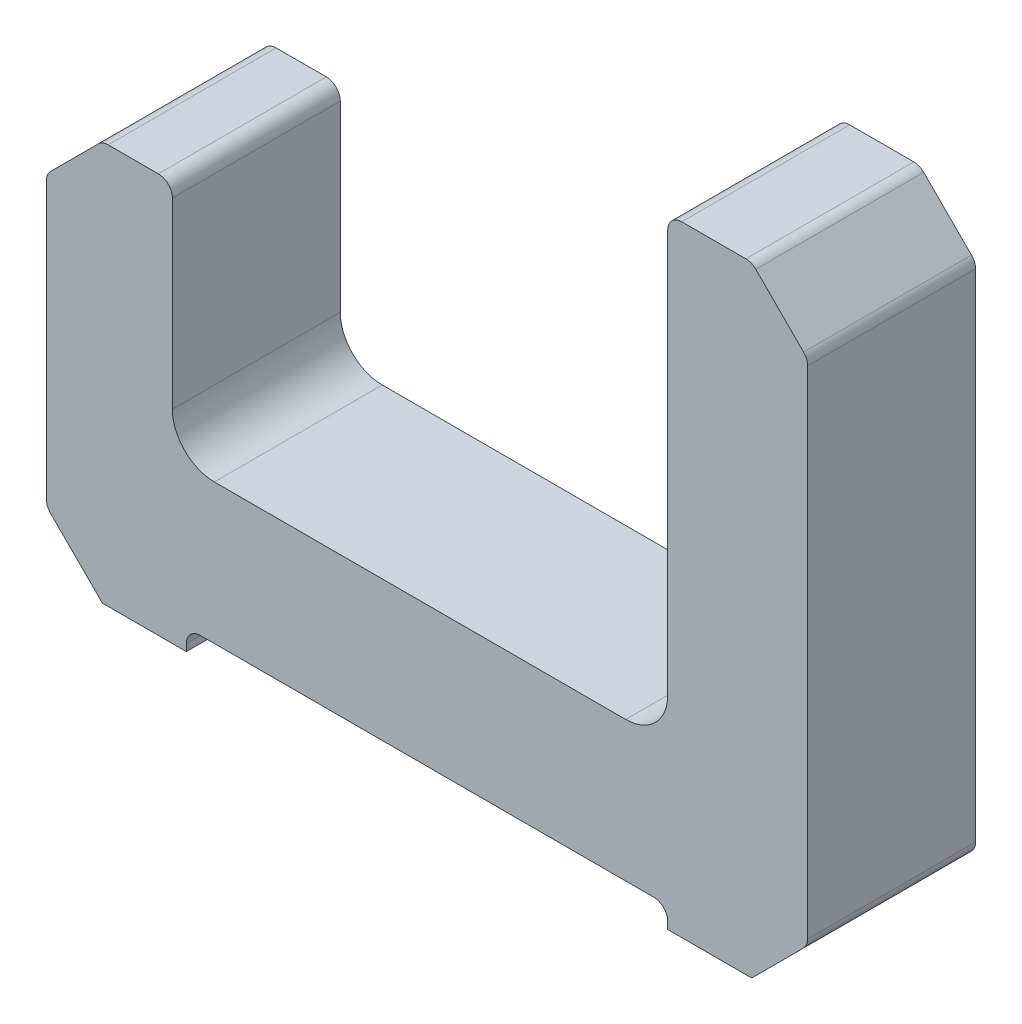
ISO-10303-21;
HEADER;
FILE_DESCRIPTION(('STEP AP214'),'2;1');
FILE_NAME('part.step','',(''),(''),'','','');
FILE_SCHEMA(('AUTOMOTIVE_DESIGN { 1 0 10303 214 1 1 1 1 }'));
ENDSEC;
DATA;
#1=APPLICATION_CONTEXT('core data for automotive mechanical design processes');
#2=APPLICATION_PROTOCOL_DEFINITION('international standard','automotive_design',2000,#1);
#3=PRODUCT_CONTEXT('',#1,'mechanical');
#4=PRODUCT('Part','Part','',(#3));
#5=PRODUCT_RELATED_PRODUCT_CATEGORY('part','',(#4));
#6=PRODUCT_DEFINITION_FORMATION('','',#4);
#7=PRODUCT_DEFINITION_CONTEXT('part definition',#1,'design');
#8=PRODUCT_DEFINITION('design','',#6,#7);
#9=PRODUCT_DEFINITION_SHAPE('','',#8);
#10=(LENGTH_UNIT() NAMED_UNIT(*) SI_UNIT(.MILLI.,.METRE.));
#11=(NAMED_UNIT(*) PLANE_ANGLE_UNIT() SI_UNIT($,.RADIAN.));
#12=(NAMED_UNIT(*) SI_UNIT($,.STERADIAN.) SOLID_ANGLE_UNIT());
#13=UNCERTAINTY_MEASURE_WITH_UNIT(LENGTH_MEASURE(1.E-05),#10,'distance_accuracy_value','');
#14=(GEOMETRIC_REPRESENTATION_CONTEXT(3) GLOBAL_UNCERTAINTY_ASSIGNED_CONTEXT((#13)) GLOBAL_UNIT_ASSIGNED_CONTEXT((#10,
#11,#12)) REPRESENTATION_CONTEXT('',''));
#15=CARTESIAN_POINT('',(0.,0.,0.));
#16=DIRECTION('',(0.,0.,1.));
#17=DIRECTION('',(1.,0.,0.));
#18=AXIS2_PLACEMENT_3D('',#15,#16,#17);
#19=CARTESIAN_POINT('',(-133.5,-57.5,-30.));
#20=DIRECTION('',(-1.,0.,0.));
#21=DIRECTION('',(0.,0.,1.));
#22=AXIS2_PLACEMENT_3D('',#19,#20,#21);
#23=PLANE('',#22);
#24=DIRECTION('',(0.,-1.,0.));
#25=VECTOR('',#24,1.);
#26=CARTESIAN_POINT('',(-133.5,-57.5,-30.));
#27=LINE('',#26,#25);
#28=CARTESIAN_POINT('',(-133.5,63.267387760078,-30.));
#29=VERTEX_POINT('',#28);
#30=CARTESIAN_POINT('',(-133.5,-35.4289321881344,-30.));
#31=VERTEX_POINT('',#30);
#32=EDGE_CURVE('E271',#29,#31,#27,.T.);
#33=ORIENTED_EDGE('',*,*,#32,.T.);
#34=DIRECTION('',(0.,0.,-1.));
#35=VECTOR('',#34,1.);
#36=CARTESIAN_POINT('',(-133.5,-35.4289321881344,-30.));
#37=LINE('',#36,#35);
#38=CARTESIAN_POINT('',(-133.5,-35.4289321881344,30.));
#39=VERTEX_POINT('',#38);
#40=EDGE_CURVE('E396',#31,#39,#37,.F.);
#41=ORIENTED_EDGE('',*,*,#40,.T.);
#42=DIRECTION('',(0.,-1.,0.));
#43=VECTOR('',#42,1.);
#44=CARTESIAN_POINT('',(-133.5,-57.5,30.));
#45=LINE('',#44,#43);
#46=CARTESIAN_POINT('',(-133.5,63.267387760078,30.));
#47=VERTEX_POINT('',#46);
#48=EDGE_CURVE('E227',#47,#39,#45,.T.);
#49=ORIENTED_EDGE('',*,*,#48,.F.);
#50=DIRECTION('',(0.,0.,1.));
#51=VECTOR('',#50,1.);
#52=CARTESIAN_POINT('',(-133.5,63.267387760078,-30.));
#53=LINE('',#52,#51);
#54=EDGE_CURVE('E393',#47,#29,#53,.F.);
#55=ORIENTED_EDGE('',*,*,#54,.T.);
#56=EDGE_LOOP('',(#33,#41,#49,#55));
#57=FACE_BOUND('',#56,.T.);
#58=ADVANCED_FACE('F33',(#57),#23,.T.);
#59=CARTESIAN_POINT('',(-133.5,85.3384555719439,-30.));
#60=DIRECTION('',(0.,1.,0.));
#61=DIRECTION('',(0.,0.,1.));
#62=AXIS2_PLACEMENT_3D('',#59,#60,#61);
#63=PLANE('',#62);
#64=DIRECTION('',(-1.,0.,0.));
#65=VECTOR('',#64,1.);
#66=CARTESIAN_POINT('',(-133.5,85.3384555719439,-30.));
#67=LINE('',#66,#65);
#68=CARTESIAN_POINT('',(-93.5,85.3384555719439,-30.));
#69=VERTEX_POINT('',#68);
#70=CARTESIAN_POINT('',(-111.428932188134,85.3384555719439,-30.));
#71=VERTEX_POINT('',#70);
#72=EDGE_CURVE('E238',#69,#71,#67,.T.);
#73=ORIENTED_EDGE('',*,*,#72,.T.);
#74=DIRECTION('',(0.,0.,-1.));
#75=VECTOR('',#74,1.);
#76=CARTESIAN_POINT('',(-111.428932188134,85.3384555719439,-30.));
#77=LINE('',#76,#75);
#78=CARTESIAN_POINT('',(-111.428932188134,85.3384555719439,30.));
#79=VERTEX_POINT('',#78);
#80=EDGE_CURVE('E406',#71,#79,#77,.F.);
#81=ORIENTED_EDGE('',*,*,#80,.T.);
#82=DIRECTION('',(-1.,0.,0.));
#83=VECTOR('',#82,1.);
#84=CARTESIAN_POINT('',(-133.5,85.3384555719439,30.));
#85=LINE('',#84,#83);
#86=CARTESIAN_POINT('',(-93.5,85.3384555719439,30.));
#87=VERTEX_POINT('',#86);
#88=EDGE_CURVE('E269',#87,#79,#85,.T.);
#89=ORIENTED_EDGE('',*,*,#88,.F.);
#90=DIRECTION('',(0.,0.,1.));
#91=VECTOR('',#90,1.);
#92=CARTESIAN_POINT('',(-93.5,85.3384555719439,-30.));
#93=LINE('',#92,#91);
#94=EDGE_CURVE('E404',#87,#69,#93,.F.);
#95=ORIENTED_EDGE('',*,*,#94,.T.);
#96=EDGE_LOOP('',(#73,#81,#89,#95));
#97=FACE_BOUND('',#96,.T.);
#98=ADVANCED_FACE('F515',(#97),#63,.T.);
#99=CARTESIAN_POINT('',(-88.5,85.3384555719439,-30.));
#100=DIRECTION('',(1.,0.,0.));
#101=DIRECTION('',(0.,1.,0.));
#102=AXIS2_PLACEMENT_3D('',#99,#100,#101);
#103=PLANE('',#102);
#104=DIRECTION('',(0.,1.,0.));
#105=VECTOR('',#104,1.);
#106=CARTESIAN_POINT('',(-88.5,85.3384555719439,-30.));
#107=LINE('',#106,#105);
#108=CARTESIAN_POINT('',(-88.5,15.,-30.));
#109=VERTEX_POINT('',#108);
#110=CARTESIAN_POINT('',(-88.5,80.3384555719439,-30.));
#111=VERTEX_POINT('',#110);
#112=EDGE_CURVE('E296',#109,#111,#107,.T.);
#113=ORIENTED_EDGE('',*,*,#112,.T.);
#114=DIRECTION('',(0.,0.,1.));
#115=VECTOR('',#114,1.);
#116=CARTESIAN_POINT('',(-88.5,80.3384555719439,-30.));
#117=LINE('',#116,#115);
#118=CARTESIAN_POINT('',(-88.5,80.3384555719439,30.));
#119=VERTEX_POINT('',#118);
#120=EDGE_CURVE('E409',#111,#119,#117,.T.);
#121=ORIENTED_EDGE('',*,*,#120,.T.);
#122=DIRECTION('',(0.,1.,0.));
#123=VECTOR('',#122,1.);
#124=CARTESIAN_POINT('',(-88.5,85.3384555719439,30.));
#125=LINE('',#124,#123);
#126=CARTESIAN_POINT('',(-88.5,15.,30.));
#127=VERTEX_POINT('',#126);
#128=EDGE_CURVE('E266',#127,#119,#125,.T.);
#129=ORIENTED_EDGE('',*,*,#128,.F.);
#130=DIRECTION('',(0.,0.,1.));
#131=VECTOR('',#130,1.);
#132=CARTESIAN_POINT('',(-88.5,15.,-30.));
#133=LINE('',#132,#131);
#134=EDGE_CURVE('E335',#127,#109,#133,.F.);
#135=ORIENTED_EDGE('',*,*,#134,.T.);
#136=EDGE_LOOP('',(#113,#121,#129,#135));
#137=FACE_BOUND('',#136,.T.);
#138=ADVANCED_FACE('F506',(#137),#103,.T.);
#139=CARTESIAN_POINT('',(-88.5,0.,-30.));
#140=DIRECTION('',(0.,1.,0.));
#141=DIRECTION('',(0.,0.,1.));
#142=AXIS2_PLACEMENT_3D('',#139,#140,#141);
#143=PLANE('',#142);
#144=DIRECTION('',(-1.,0.,0.));
#145=VECTOR('',#144,1.);
#146=CARTESIAN_POINT('',(-88.5,0.,30.));
#147=LINE('',#146,#145);
#148=CARTESIAN_POINT('',(73.5,0.,30.));
#149=VERTEX_POINT('',#148);
#150=CARTESIAN_POINT('',(-73.5,0.,30.));
#151=VERTEX_POINT('',#150);
#152=EDGE_CURVE('E263',#149,#151,#147,.T.);
#153=ORIENTED_EDGE('',*,*,#152,.F.);
#154=DIRECTION('',(0.,0.,1.));
#155=VECTOR('',#154,1.);
#156=CARTESIAN_POINT('',(73.5,0.,-30.));
#157=LINE('',#156,#155);
#158=CARTESIAN_POINT('',(73.5,0.,-30.));
#159=VERTEX_POINT('',#158);
#160=EDGE_CURVE('E333',#149,#159,#157,.F.);
#161=ORIENTED_EDGE('',*,*,#160,.T.);
#162=DIRECTION('',(-1.,0.,0.));
#163=VECTOR('',#162,1.);
#164=CARTESIAN_POINT('',(-88.5,0.,-30.));
#165=LINE('',#164,#163);
#166=CARTESIAN_POINT('',(-73.5,0.,-30.));
#167=VERTEX_POINT('',#166);
#168=EDGE_CURVE('E293',#159,#167,#165,.T.);
#169=ORIENTED_EDGE('',*,*,#168,.T.);
#170=DIRECTION('',(0.,0.,1.));
#171=VECTOR('',#170,1.);
#172=CARTESIAN_POINT('',(-73.5,0.,30.));
#173=LINE('',#172,#171);
#174=EDGE_CURVE('E330',#167,#151,#173,.T.);
#175=ORIENTED_EDGE('',*,*,#174,.T.);
#176=EDGE_LOOP('',(#153,#161,#169,#175));
#177=FACE_BOUND('',#176,.T.);
#178=ADVANCED_FACE('F497',(#177),#143,.T.);
#179=CARTESIAN_POINT('',(88.5,0.,-30.));
#180=DIRECTION('',(-1.,0.,0.));
#181=DIRECTION('',(0.,0.,1.));
#182=AXIS2_PLACEMENT_3D('',#179,#180,#181);
#183=PLANE('',#182);
#184=DIRECTION('',(0.,-1.,0.));
#185=VECTOR('',#184,1.);
#186=CARTESIAN_POINT('',(88.5,0.,30.));
#187=LINE('',#186,#185);
#188=CARTESIAN_POINT('',(88.5,159.,30.));
#189=VERTEX_POINT('',#188);
#190=CARTESIAN_POINT('',(88.5,15.,30.));
#191=VERTEX_POINT('',#190);
#192=EDGE_CURVE('E261',#189,#191,#187,.T.);
#193=ORIENTED_EDGE('',*,*,#192,.F.);
#194=DIRECTION('',(0.,0.,1.));
#195=VECTOR('',#194,1.);
#196=CARTESIAN_POINT('',(88.5,159.,-30.));
#197=LINE('',#196,#195);
#198=CARTESIAN_POINT('',(88.5,159.,-30.));
#199=VERTEX_POINT('',#198);
#200=EDGE_CURVE('E422',#189,#199,#197,.F.);
#201=ORIENTED_EDGE('',*,*,#200,.T.);
#202=DIRECTION('',(0.,-1.,0.));
#203=VECTOR('',#202,1.);
#204=CARTESIAN_POINT('',(88.5,0.,-30.));
#205=LINE('',#204,#203);
#206=CARTESIAN_POINT('',(88.5,15.,-30.));
#207=VERTEX_POINT('',#206);
#208=EDGE_CURVE('E291',#199,#207,#205,.T.);
#209=ORIENTED_EDGE('',*,*,#208,.T.);
#210=DIRECTION('',(0.,0.,1.));
#211=VECTOR('',#210,1.);
#212=CARTESIAN_POINT('',(88.5,15.,30.));
#213=LINE('',#212,#211);
#214=EDGE_CURVE('E327',#207,#191,#213,.T.);
#215=ORIENTED_EDGE('',*,*,#214,.T.);
#216=EDGE_LOOP('',(#193,#201,#209,#215));
#217=FACE_BOUND('',#216,.T.);
#218=ADVANCED_FACE('F488',(#217),#183,.T.);
#219=CARTESIAN_POINT('',(88.5,164.,-30.));
#220=DIRECTION('',(0.,1.,0.));
#221=DIRECTION('',(0.,0.,1.));
#222=AXIS2_PLACEMENT_3D('',#219,#220,#221);
#223=PLANE('',#222);
#224=DIRECTION('',(-1.,0.,0.));
#225=VECTOR('',#224,1.);
#226=CARTESIAN_POINT('',(88.5,164.,30.));
#227=LINE('',#226,#225);
#228=CARTESIAN_POINT('',(116.428932188134,164.,30.));
#229=VERTEX_POINT('',#228);
#230=CARTESIAN_POINT('',(93.5,164.,30.));
#231=VERTEX_POINT('',#230);
#232=EDGE_CURVE('E258',#229,#231,#227,.T.);
#233=ORIENTED_EDGE('',*,*,#232,.F.);
#234=DIRECTION('',(0.,0.,1.));
#235=VECTOR('',#234,1.);
#236=CARTESIAN_POINT('',(116.428932188134,164.,-30.));
#237=LINE('',#236,#235);
#238=CARTESIAN_POINT('',(116.428932188134,164.,-30.));
#239=VERTEX_POINT('',#238);
#240=EDGE_CURVE('E419',#229,#239,#237,.F.);
#241=ORIENTED_EDGE('',*,*,#240,.T.);
#242=DIRECTION('',(-1.,0.,0.));
#243=VECTOR('',#242,1.);
#244=CARTESIAN_POINT('',(88.5,164.,-30.));
#245=LINE('',#244,#243);
#246=CARTESIAN_POINT('',(93.5,164.,-30.));
#247=VERTEX_POINT('',#246);
#248=EDGE_CURVE('E288',#239,#247,#245,.T.);
#249=ORIENTED_EDGE('',*,*,#248,.T.);
#250=DIRECTION('',(0.,0.,1.));
#251=VECTOR('',#250,1.);
#252=CARTESIAN_POINT('',(93.5,164.,-30.));
#253=LINE('',#252,#251);
#254=EDGE_CURVE('E416',#247,#231,#253,.T.);
#255=ORIENTED_EDGE('',*,*,#254,.T.);
#256=EDGE_LOOP('',(#233,#241,#249,#255));
#257=FACE_BOUND('',#256,.T.);
#258=ADVANCED_FACE('F479',(#257),#223,.T.);
#259=CARTESIAN_POINT('',(138.5,164.,-30.));
#260=DIRECTION('',(1.,0.,0.));
#261=DIRECTION('',(0.,1.,0.));
#262=AXIS2_PLACEMENT_3D('',#259,#260,#261);
#263=PLANE('',#262);
#264=DIRECTION('',(0.,1.,0.));
#265=VECTOR('',#264,1.);
#266=CARTESIAN_POINT('',(138.5,164.,30.));
#267=LINE('',#266,#265);
#268=CARTESIAN_POINT('',(138.5,-35.4289321881342,30.));
#269=VERTEX_POINT('',#268);
#270=CARTESIAN_POINT('',(138.5,141.928932188134,30.));
#271=VERTEX_POINT('',#270);
#272=EDGE_CURVE('E255',#269,#271,#267,.T.);
#273=ORIENTED_EDGE('',*,*,#272,.F.);
#274=DIRECTION('',(0.,0.,1.));
#275=VECTOR('',#274,1.);
#276=CARTESIAN_POINT('',(138.5,-35.4289321881342,-30.));
#277=LINE('',#276,#275);
#278=CARTESIAN_POINT('',(138.5,-35.4289321881342,-30.));
#279=VERTEX_POINT('',#278);
#280=EDGE_CURVE('E349',#269,#279,#277,.F.);
#281=ORIENTED_EDGE('',*,*,#280,.T.);
#282=DIRECTION('',(0.,1.,0.));
#283=VECTOR('',#282,1.);
#284=CARTESIAN_POINT('',(138.5,164.,-30.));
#285=LINE('',#284,#283);
#286=CARTESIAN_POINT('',(138.5,141.928932188134,-30.));
#287=VERTEX_POINT('',#286);
#288=EDGE_CURVE('E285',#279,#287,#285,.T.);
#289=ORIENTED_EDGE('',*,*,#288,.T.);
#290=DIRECTION('',(0.,0.,-1.));
#291=VECTOR('',#290,1.);
#292=CARTESIAN_POINT('',(138.5,141.928932188134,-30.));
#293=LINE('',#292,#291);
#294=EDGE_CURVE('E346',#287,#271,#293,.F.);
#295=ORIENTED_EDGE('',*,*,#294,.T.);
#296=EDGE_LOOP('',(#273,#281,#289,#295));
#297=FACE_BOUND('',#296,.T.);
#298=ADVANCED_FACE('F461',(#297),#263,.T.);
#299=CARTESIAN_POINT('',(138.5,-57.5,-30.));
#300=DIRECTION('',(0.,-1.,0.));
#301=DIRECTION('',(1.,0.,0.));
#302=AXIS2_PLACEMENT_3D('',#299,#300,#301);
#303=PLANE('',#302);
#304=DIRECTION('',(1.,0.,0.));
#305=VECTOR('',#304,1.);
#306=CARTESIAN_POINT('',(138.5,-57.5,-30.));
#307=LINE('',#306,#305);
#308=CARTESIAN_POINT('',(88.5,-57.5,-30.));
#309=VERTEX_POINT('',#308);
#310=CARTESIAN_POINT('',(118.5,-57.5,-30.));
#311=VERTEX_POINT('',#310);
#312=EDGE_CURVE('E282',#309,#311,#307,.T.);
#313=ORIENTED_EDGE('',*,*,#312,.T.);
#314=DIRECTION('',(0.,0.,1.));
#315=VECTOR('',#314,1.);
#316=CARTESIAN_POINT('',(118.5,-57.5,-30.));
#317=LINE('',#316,#315);
#318=CARTESIAN_POINT('',(118.5,-57.5,30.));
#319=VERTEX_POINT('',#318);
#320=EDGE_CURVE('E324',#311,#319,#317,.T.);
#321=ORIENTED_EDGE('',*,*,#320,.T.);
#322=DIRECTION('',(1.,0.,0.));
#323=VECTOR('',#322,1.);
#324=CARTESIAN_POINT('',(138.5,-57.5,30.));
#325=LINE('',#324,#323);
#326=CARTESIAN_POINT('',(88.5,-57.5,30.));
#327=VERTEX_POINT('',#326);
#328=EDGE_CURVE('E252',#327,#319,#325,.T.);
#329=ORIENTED_EDGE('',*,*,#328,.F.);
#330=DIRECTION('',(0.,0.,1.));
#331=VECTOR('',#330,1.);
#332=CARTESIAN_POINT('',(88.5,-57.5,-30.));
#333=LINE('',#332,#331);
#334=EDGE_CURVE('E237',#309,#327,#333,.T.);
#335=ORIENTED_EDGE('',*,*,#334,.F.);
#336=EDGE_LOOP('',(#313,#321,#329,#335));
#337=FACE_BOUND('',#336,.T.);
#338=ADVANCED_FACE('F451',(#337),#303,.T.);
#339=CARTESIAN_POINT('',(88.5,-57.5,-30.));
#340=DIRECTION('',(-1.,0.,0.));
#341=DIRECTION('',(0.,0.,1.));
#342=AXIS2_PLACEMENT_3D('',#339,#340,#341);
#343=PLANE('',#342);
#344=DIRECTION('',(0.,-1.,0.));
#345=VECTOR('',#344,1.);
#346=CARTESIAN_POINT('',(88.5,-57.5,30.));
#347=LINE('',#346,#345);
#348=CARTESIAN_POINT('',(88.5,-55.,30.));
#349=VERTEX_POINT('',#348);
#350=EDGE_CURVE('E247',#349,#327,#347,.T.);
#351=ORIENTED_EDGE('',*,*,#350,.F.);
#352=DIRECTION('',(0.,0.,1.));
#353=VECTOR('',#352,1.);
#354=CARTESIAN_POINT('',(88.5,-55.,-30.));
#355=LINE('',#354,#353);
#356=CARTESIAN_POINT('',(88.5,-55.,-30.));
#357=VERTEX_POINT('',#356);
#358=EDGE_CURVE('E390',#349,#357,#355,.F.);
#359=ORIENTED_EDGE('',*,*,#358,.T.);
#360=DIRECTION('',(0.,-1.,0.));
#361=VECTOR('',#360,1.);
#362=CARTESIAN_POINT('',(88.5,-57.5,-30.));
#363=LINE('',#362,#361);
#364=EDGE_CURVE('E280',#357,#309,#363,.T.);
#365=ORIENTED_EDGE('',*,*,#364,.T.);
#366=ORIENTED_EDGE('',*,*,#334,.T.);
#367=EDGE_LOOP('',(#351,#359,#365,#366));
#368=FACE_BOUND('',#367,.T.);
#369=ADVANCED_FACE('F446',(#368),#343,.T.);
#370=CARTESIAN_POINT('',(88.5,-50.,-30.));
#371=DIRECTION('',(0.,-1.,0.));
#372=DIRECTION('',(1.,0.,0.));
#373=AXIS2_PLACEMENT_3D('',#370,#371,#372);
#374=PLANE('',#373);
#375=DIRECTION('',(1.,0.,0.));
#376=VECTOR('',#375,1.);
#377=CARTESIAN_POINT('',(88.5,-50.,-30.));
#378=LINE('',#377,#376);
#379=CARTESIAN_POINT('',(-78.5,-50.,-30.));
#380=VERTEX_POINT('',#379);
#381=CARTESIAN_POINT('',(83.5,-50.,-30.));
#382=VERTEX_POINT('',#381);
#383=EDGE_CURVE('E277',#380,#382,#378,.T.);
#384=ORIENTED_EDGE('',*,*,#383,.T.);
#385=DIRECTION('',(0.,0.,1.));
#386=VECTOR('',#385,1.);
#387=CARTESIAN_POINT('',(83.5,-50.,30.));
#388=LINE('',#387,#386);
#389=CARTESIAN_POINT('',(83.5,-50.,30.));
#390=VERTEX_POINT('',#389);
#391=EDGE_CURVE('E387',#382,#390,#388,.T.);
#392=ORIENTED_EDGE('',*,*,#391,.T.);
#393=DIRECTION('',(1.,0.,0.));
#394=VECTOR('',#393,1.);
#395=CARTESIAN_POINT('',(88.5,-50.,30.));
#396=LINE('',#395,#394);
#397=CARTESIAN_POINT('',(-78.5,-50.,30.));
#398=VERTEX_POINT('',#397);
#399=EDGE_CURVE('E244',#398,#390,#396,.T.);
#400=ORIENTED_EDGE('',*,*,#399,.F.);
#401=DIRECTION('',(0.,0.,1.));
#402=VECTOR('',#401,1.);
#403=CARTESIAN_POINT('',(-78.5,-50.,-30.));
#404=LINE('',#403,#402);
#405=EDGE_CURVE('E385',#398,#380,#404,.F.);
#406=ORIENTED_EDGE('',*,*,#405,.T.);
#407=EDGE_LOOP('',(#384,#392,#400,#406));
#408=FACE_BOUND('',#407,.T.);
#409=ADVANCED_FACE('F431',(#408),#374,.T.);
#410=CARTESIAN_POINT('',(-83.5,-50.,-30.));
#411=DIRECTION('',(1.,0.,0.));
#412=DIRECTION('',(0.,1.,0.));
#413=AXIS2_PLACEMENT_3D('',#410,#411,#412);
#414=PLANE('',#413);
#415=DIRECTION('',(0.,1.,0.));
#416=VECTOR('',#415,1.);
#417=CARTESIAN_POINT('',(-83.5,-50.,-30.));
#418=LINE('',#417,#416);
#419=CARTESIAN_POINT('',(-83.5,-57.5,-30.));
#420=VERTEX_POINT('',#419);
#421=CARTESIAN_POINT('',(-83.5,-55.,-30.));
#422=VERTEX_POINT('',#421);
#423=EDGE_CURVE('E275',#420,#422,#418,.T.);
#424=ORIENTED_EDGE('',*,*,#423,.T.);
#425=DIRECTION('',(0.,0.,1.));
#426=VECTOR('',#425,1.);
#427=CARTESIAN_POINT('',(-83.5,-55.,30.));
#428=LINE('',#427,#426);
#429=CARTESIAN_POINT('',(-83.5,-55.,30.));
#430=VERTEX_POINT('',#429);
#431=EDGE_CURVE('E243',#422,#430,#428,.T.);
#432=ORIENTED_EDGE('',*,*,#431,.T.);
#433=DIRECTION('',(0.,1.,0.));
#434=VECTOR('',#433,1.);
#435=CARTESIAN_POINT('',(-83.5,-50.,30.));
#436=LINE('',#435,#434);
#437=CARTESIAN_POINT('',(-83.5,-57.5,30.));
#438=VERTEX_POINT('',#437);
#439=EDGE_CURVE('E222',#438,#430,#436,.T.);
#440=ORIENTED_EDGE('',*,*,#439,.F.);
#441=DIRECTION('',(0.,0.,1.));
#442=VECTOR('',#441,1.);
#443=CARTESIAN_POINT('',(-83.5,-57.5,-30.));
#444=LINE('',#443,#442);
#445=EDGE_CURVE('E230',#420,#438,#444,.T.);
#446=ORIENTED_EDGE('',*,*,#445,.F.);
#447=EDGE_LOOP('',(#424,#432,#440,#446));
#448=FACE_BOUND('',#447,.T.);
#449=ADVANCED_FACE('F241',(#448),#414,.T.);
#450=CARTESIAN_POINT('',(-83.5,-57.5,-30.));
#451=DIRECTION('',(0.,-1.,0.));
#452=DIRECTION('',(0.,0.,-1.));
#453=AXIS2_PLACEMENT_3D('',#450,#451,#452);
#454=PLANE('',#453);
#455=DIRECTION('',(1.,0.,0.));
#456=VECTOR('',#455,1.);
#457=CARTESIAN_POINT('',(-83.5,-57.5,30.));
#458=LINE('',#457,#456);
#459=CARTESIAN_POINT('',(-113.5,-57.5,30.));
#460=VERTEX_POINT('',#459);
#461=EDGE_CURVE('E217',#460,#438,#458,.T.);
#462=ORIENTED_EDGE('',*,*,#461,.F.);
#463=DIRECTION('',(0.,0.,-1.));
#464=VECTOR('',#463,1.);
#465=CARTESIAN_POINT('',(-113.5,-57.5,-30.));
#466=LINE('',#465,#464);
#467=CARTESIAN_POINT('',(-113.5,-57.5,-30.));
#468=VERTEX_POINT('',#467);
#469=EDGE_CURVE('E311',#460,#468,#466,.T.);
#470=ORIENTED_EDGE('',*,*,#469,.T.);
#471=DIRECTION('',(1.,0.,0.));
#472=VECTOR('',#471,1.);
#473=CARTESIAN_POINT('',(-83.5,-57.5,-30.));
#474=LINE('',#473,#472);
#475=EDGE_CURVE('E233',#468,#420,#474,.T.);
#476=ORIENTED_EDGE('',*,*,#475,.T.);
#477=ORIENTED_EDGE('',*,*,#445,.T.);
#478=EDGE_LOOP('',(#462,#470,#476,#477));
#479=FACE_BOUND('',#478,.T.);
#480=ADVANCED_FACE('F231',(#479),#454,.T.);
#481=CARTESIAN_POINT('',(0.,0.,-30.));
#482=DIRECTION('',(0.,0.,-1.));
#483=DIRECTION('',(-1.,0.,0.));
#484=AXIS2_PLACEMENT_3D('',#481,#482,#483);
#485=PLANE('',#484);
#486=ORIENTED_EDGE('',*,*,#288,.F.);
#487=CARTESIAN_POINT('',(133.5,-35.4289321881342,-30.));
#488=DIRECTION('',(0.,0.,-1.));
#489=DIRECTION('',(-1.,0.,0.));
#490=AXIS2_PLACEMENT_3D('',#487,#488,#489);
#491=CIRCLE('',#490,5.);
#492=CARTESIAN_POINT('',(137.035533905933,-38.9644660940669,-30.));
#493=VERTEX_POINT('',#492);
#494=EDGE_CURVE('E366',#279,#493,#491,.T.);
#495=ORIENTED_EDGE('',*,*,#494,.T.);
#496=DIRECTION('',(0.707106781186544,0.707106781186551,0.));
#497=VECTOR('',#496,1.);
#498=CARTESIAN_POINT('',(88.0000000000006,-87.9999999999996,-30.));
#499=LINE('',#498,#497);
#500=EDGE_CURVE('E319',#493,#311,#499,.F.);
#501=ORIENTED_EDGE('',*,*,#500,.T.);
#502=ORIENTED_EDGE('',*,*,#312,.F.);
#503=ORIENTED_EDGE('',*,*,#364,.F.);
#504=CARTESIAN_POINT('',(83.5,-55.,-30.));
#505=DIRECTION('',(0.,0.,-1.));
#506=DIRECTION('',(-1.,0.,0.));
#507=AXIS2_PLACEMENT_3D('',#504,#505,#506);
#508=CIRCLE('',#507,5.);
#509=EDGE_CURVE('E426',#357,#382,#508,.F.);
#510=ORIENTED_EDGE('',*,*,#509,.T.);
#511=ORIENTED_EDGE('',*,*,#383,.F.);
#512=CARTESIAN_POINT('',(-78.5,-55.,-30.));
#513=DIRECTION('',(0.,0.,-1.));
#514=DIRECTION('',(-1.,0.,0.));
#515=AXIS2_PLACEMENT_3D('',#512,#513,#514);
#516=CIRCLE('',#515,5.);
#517=EDGE_CURVE('E11',#380,#422,#516,.F.);
#518=ORIENTED_EDGE('',*,*,#517,.T.);
#519=ORIENTED_EDGE('',*,*,#423,.F.);
#520=ORIENTED_EDGE('',*,*,#475,.F.);
#521=DIRECTION('',(0.707106781186551,-0.707106781186544,0.));
#522=VECTOR('',#521,1.);
#523=CARTESIAN_POINT('',(-85.4999999999993,-85.5000000000001,-30.));
#524=LINE('',#523,#522);
#525=CARTESIAN_POINT('',(-132.035533905933,-38.9644660940671,-30.));
#526=VERTEX_POINT('',#525);
#527=EDGE_CURVE('E321',#468,#526,#524,.F.);
#528=ORIENTED_EDGE('',*,*,#527,.T.);
#529=CARTESIAN_POINT('',(-128.5,-35.4289321881344,-30.));
#530=DIRECTION('',(0.,0.,-1.));
#531=DIRECTION('',(-1.,0.,0.));
#532=AXIS2_PLACEMENT_3D('',#529,#530,#531);
#533=CIRCLE('',#532,5.);
#534=EDGE_CURVE('E364',#526,#31,#533,.T.);
#535=ORIENTED_EDGE('',*,*,#534,.T.);
#536=ORIENTED_EDGE('',*,*,#32,.F.);
#537=CARTESIAN_POINT('',(-128.5,63.267387760078,-30.));
#538=DIRECTION('',(0.,0.,-1.));
#539=DIRECTION('',(-1.,0.,0.));
#540=AXIS2_PLACEMENT_3D('',#537,#538,#539);
#541=CIRCLE('',#540,5.);
#542=CARTESIAN_POINT('',(-132.035533905933,66.8029216660108,-30.));
#543=VERTEX_POINT('',#542);
#544=EDGE_CURVE('E362',#29,#543,#541,.T.);
#545=ORIENTED_EDGE('',*,*,#544,.T.);
#546=DIRECTION('',(-0.707106781186544,-0.707106781186551,0.));
#547=VECTOR('',#546,1.);
#548=CARTESIAN_POINT('',(-99.4192277859725,99.4192277859714,-30.));
#549=LINE('',#548,#547);
#550=CARTESIAN_POINT('',(-114.964466094067,83.8739894778766,-30.));
#551=VERTEX_POINT('',#550);
#552=EDGE_CURVE('E313',#543,#551,#549,.F.);
#553=ORIENTED_EDGE('',*,*,#552,.T.);
#554=CARTESIAN_POINT('',(-111.428932188134,80.3384555719439,-30.));
#555=DIRECTION('',(0.,0.,-1.));
#556=DIRECTION('',(-1.,0.,0.));
#557=AXIS2_PLACEMENT_3D('',#554,#555,#556);
#558=CIRCLE('',#557,5.);
#559=EDGE_CURVE('E360',#551,#71,#558,.T.);
#560=ORIENTED_EDGE('',*,*,#559,.T.);
#561=ORIENTED_EDGE('',*,*,#72,.F.);
#562=CARTESIAN_POINT('',(-93.5,80.3384555719439,-30.));
#563=DIRECTION('',(0.,0.,-1.));
#564=DIRECTION('',(-1.,0.,0.));
#565=AXIS2_PLACEMENT_3D('',#562,#563,#564);
#566=CIRCLE('',#565,5.);
#567=EDGE_CURVE('E358',#69,#111,#566,.T.);
#568=ORIENTED_EDGE('',*,*,#567,.T.);
#569=ORIENTED_EDGE('',*,*,#112,.F.);
#570=CARTESIAN_POINT('',(-73.5,15.,-30.));
#571=DIRECTION('',(0.,0.,-1.));
#572=DIRECTION('',(-1.,0.,0.));
#573=AXIS2_PLACEMENT_3D('',#570,#571,#572);
#574=CIRCLE('',#573,15.);
#575=EDGE_CURVE('E344',#109,#167,#574,.F.);
#576=ORIENTED_EDGE('',*,*,#575,.T.);
#577=ORIENTED_EDGE('',*,*,#168,.F.);
#578=CARTESIAN_POINT('',(73.5,15.,-30.));
#579=DIRECTION('',(0.,0.,-1.));
#580=DIRECTION('',(-1.,0.,0.));
#581=AXIS2_PLACEMENT_3D('',#578,#579,#580);
#582=CIRCLE('',#581,15.);
#583=EDGE_CURVE('E339',#159,#207,#582,.F.);
#584=ORIENTED_EDGE('',*,*,#583,.T.);
#585=ORIENTED_EDGE('',*,*,#208,.F.);
#586=CARTESIAN_POINT('',(93.5,159.,-30.));
#587=DIRECTION('',(0.,0.,-1.));
#588=DIRECTION('',(-1.,0.,0.));
#589=AXIS2_PLACEMENT_3D('',#586,#587,#588);
#590=CIRCLE('',#589,5.);
#591=EDGE_CURVE('E352',#199,#247,#590,.T.);
#592=ORIENTED_EDGE('',*,*,#591,.T.);
#593=ORIENTED_EDGE('',*,*,#248,.F.);
#594=CARTESIAN_POINT('',(116.428932188134,159.,-30.));
#595=DIRECTION('',(0.,0.,-1.));
#596=DIRECTION('',(-1.,0.,0.));
#597=AXIS2_PLACEMENT_3D('',#594,#595,#596);
#598=CIRCLE('',#597,5.);
#599=CARTESIAN_POINT('',(119.964466094067,162.535533905933,-30.));
#600=VERTEX_POINT('',#599);
#601=EDGE_CURVE('E354',#239,#600,#598,.T.);
#602=ORIENTED_EDGE('',*,*,#601,.T.);
#603=DIRECTION('',(-0.707106781186551,0.707106781186544,0.));
#604=VECTOR('',#603,1.);
#605=CARTESIAN_POINT('',(141.249999999999,141.250000000001,-30.));
#606=LINE('',#605,#604);
#607=CARTESIAN_POINT('',(137.035533905933,145.464466094067,-30.));
#608=VERTEX_POINT('',#607);
#609=EDGE_CURVE('E316',#600,#608,#606,.F.);
#610=ORIENTED_EDGE('',*,*,#609,.T.);
#611=CARTESIAN_POINT('',(133.5,141.928932188134,-30.));
#612=DIRECTION('',(0.,0.,-1.));
#613=DIRECTION('',(-1.,0.,0.));
#614=AXIS2_PLACEMENT_3D('',#611,#612,#613);
#615=CIRCLE('',#614,5.);
#616=EDGE_CURVE('E356',#608,#287,#615,.T.);
#617=ORIENTED_EDGE('',*,*,#616,.T.);
#618=EDGE_LOOP('',(#486,#495,#501,#502,#503,#510,#511,#518,#519,#520,#528,#535,#536,#545,#553,
#560,#561,#568,#569,#576,#577,#584,#585,#592,#593,#602,#610,#617));
#619=FACE_BOUND('',#618,.T.);
#620=ADVANCED_FACE('F438',(#619),#485,.T.);
#621=CARTESIAN_POINT('',(0.,0.,30.));
#622=DIRECTION('',(0.,0.,-1.));
#623=DIRECTION('',(-1.,0.,0.));
#624=AXIS2_PLACEMENT_3D('',#621,#622,#623);
#625=PLANE('',#624);
#626=DIRECTION('',(-0.707106781186544,-0.707106781186551,0.));
#627=VECTOR('',#626,1.);
#628=CARTESIAN_POINT('',(118.5,-57.5,30.));
#629=LINE('',#628,#627);
#630=CARTESIAN_POINT('',(137.035533905933,-38.9644660940669,30.));
#631=VERTEX_POINT('',#630);
#632=EDGE_CURVE('E308',#319,#631,#629,.F.);
#633=ORIENTED_EDGE('',*,*,#632,.T.);
#634=CARTESIAN_POINT('',(133.5,-35.4289321881342,30.));
#635=DIRECTION('',(0.,0.,-1.));
#636=DIRECTION('',(-1.,0.,0.));
#637=AXIS2_PLACEMENT_3D('',#634,#635,#636);
#638=CIRCLE('',#637,5.);
#639=EDGE_CURVE('E383',#631,#269,#638,.F.);
#640=ORIENTED_EDGE('',*,*,#639,.T.);
#641=ORIENTED_EDGE('',*,*,#272,.T.);
#642=CARTESIAN_POINT('',(133.5,141.928932188134,30.));
#643=DIRECTION('',(0.,0.,-1.));
#644=DIRECTION('',(-1.,0.,0.));
#645=AXIS2_PLACEMENT_3D('',#642,#643,#644);
#646=CIRCLE('',#645,5.);
#647=CARTESIAN_POINT('',(137.035533905933,145.464466094067,30.));
#648=VERTEX_POINT('',#647);
#649=EDGE_CURVE('E374',#271,#648,#646,.F.);
#650=ORIENTED_EDGE('',*,*,#649,.T.);
#651=DIRECTION('',(0.707106781186551,-0.707106781186544,0.));
#652=VECTOR('',#651,1.);
#653=CARTESIAN_POINT('',(138.5,144.,30.));
#654=LINE('',#653,#652);
#655=CARTESIAN_POINT('',(119.964466094067,162.535533905933,30.));
#656=VERTEX_POINT('',#655);
#657=EDGE_CURVE('E305',#648,#656,#654,.F.);
#658=ORIENTED_EDGE('',*,*,#657,.T.);
#659=CARTESIAN_POINT('',(116.428932188134,159.,30.));
#660=DIRECTION('',(0.,0.,-1.));
#661=DIRECTION('',(-1.,0.,0.));
#662=AXIS2_PLACEMENT_3D('',#659,#660,#661);
#663=CIRCLE('',#662,5.);
#664=EDGE_CURVE('E372',#656,#229,#663,.F.);
#665=ORIENTED_EDGE('',*,*,#664,.T.);
#666=ORIENTED_EDGE('',*,*,#232,.T.);
#667=CARTESIAN_POINT('',(93.5,159.,30.));
#668=DIRECTION('',(0.,0.,-1.));
#669=DIRECTION('',(-1.,0.,0.));
#670=AXIS2_PLACEMENT_3D('',#667,#668,#669);
#671=CIRCLE('',#670,5.);
#672=EDGE_CURVE('E370',#231,#189,#671,.F.);
#673=ORIENTED_EDGE('',*,*,#672,.T.);
#674=ORIENTED_EDGE('',*,*,#192,.T.);
#675=CARTESIAN_POINT('',(73.5,15.,30.));
#676=DIRECTION('',(0.,0.,-1.));
#677=DIRECTION('',(-1.,0.,0.));
#678=AXIS2_PLACEMENT_3D('',#675,#676,#677);
#679=CIRCLE('',#678,15.);
#680=EDGE_CURVE('E337',#191,#149,#679,.T.);
#681=ORIENTED_EDGE('',*,*,#680,.T.);
#682=ORIENTED_EDGE('',*,*,#152,.T.);
#683=CARTESIAN_POINT('',(-73.5,15.,30.));
#684=DIRECTION('',(0.,0.,-1.));
#685=DIRECTION('',(-1.,0.,0.));
#686=AXIS2_PLACEMENT_3D('',#683,#684,#685);
#687=CIRCLE('',#686,15.);
#688=EDGE_CURVE('E342',#151,#127,#687,.T.);
#689=ORIENTED_EDGE('',*,*,#688,.T.);
#690=ORIENTED_EDGE('',*,*,#128,.T.);
#691=CARTESIAN_POINT('',(-93.5,80.3384555719439,30.));
#692=DIRECTION('',(0.,0.,-1.));
#693=DIRECTION('',(-1.,0.,0.));
#694=AXIS2_PLACEMENT_3D('',#691,#692,#693);
#695=CIRCLE('',#694,5.);
#696=EDGE_CURVE('E376',#119,#87,#695,.F.);
#697=ORIENTED_EDGE('',*,*,#696,.T.);
#698=ORIENTED_EDGE('',*,*,#88,.T.);
#699=CARTESIAN_POINT('',(-111.428932188134,80.3384555719439,30.));
#700=DIRECTION('',(0.,0.,-1.));
#701=DIRECTION('',(-1.,0.,0.));
#702=AXIS2_PLACEMENT_3D('',#699,#700,#701);
#703=CIRCLE('',#702,5.);
#704=CARTESIAN_POINT('',(-114.964466094067,83.8739894778766,30.));
#705=VERTEX_POINT('',#704);
#706=EDGE_CURVE('E55',#79,#705,#703,.F.);
#707=ORIENTED_EDGE('',*,*,#706,.T.);
#708=DIRECTION('',(0.707106781186544,0.707106781186551,0.));
#709=VECTOR('',#708,1.);
#710=CARTESIAN_POINT('',(-113.5,85.3384555719439,30.));
#711=LINE('',#710,#709);
#712=CARTESIAN_POINT('',(-132.035533905933,66.8029216660108,30.));
#713=VERTEX_POINT('',#712);
#714=EDGE_CURVE('E302',#705,#713,#711,.F.);
#715=ORIENTED_EDGE('',*,*,#714,.T.);
#716=CARTESIAN_POINT('',(-128.5,63.267387760078,30.));
#717=DIRECTION('',(0.,0.,-1.));
#718=DIRECTION('',(-1.,0.,0.));
#719=AXIS2_PLACEMENT_3D('',#716,#717,#718);
#720=CIRCLE('',#719,5.);
#721=EDGE_CURVE('E379',#713,#47,#720,.F.);
#722=ORIENTED_EDGE('',*,*,#721,.T.);
#723=ORIENTED_EDGE('',*,*,#48,.T.);
#724=CARTESIAN_POINT('',(-128.5,-35.4289321881344,30.));
#725=DIRECTION('',(0.,0.,-1.));
#726=DIRECTION('',(-1.,0.,0.));
#727=AXIS2_PLACEMENT_3D('',#724,#725,#726);
#728=CIRCLE('',#727,5.);
#729=CARTESIAN_POINT('',(-132.035533905933,-38.9644660940672,30.));
#730=VERTEX_POINT('',#729);
#731=EDGE_CURVE('E381',#39,#730,#728,.F.);
#732=ORIENTED_EDGE('',*,*,#731,.T.);
#733=DIRECTION('',(-0.707106781186551,0.707106781186544,0.));
#734=VECTOR('',#733,1.);
#735=CARTESIAN_POINT('',(-133.5,-37.4999999999999,30.));
#736=LINE('',#735,#734);
#737=EDGE_CURVE('E224',#730,#460,#736,.F.);
#738=ORIENTED_EDGE('',*,*,#737,.T.);
#739=ORIENTED_EDGE('',*,*,#461,.T.);
#740=ORIENTED_EDGE('',*,*,#439,.T.);
#741=CARTESIAN_POINT('',(-78.5,-55.,30.));
#742=DIRECTION('',(0.,0.,-1.));
#743=DIRECTION('',(-1.,0.,0.));
#744=AXIS2_PLACEMENT_3D('',#741,#742,#743);
#745=CIRCLE('',#744,5.);
#746=EDGE_CURVE('E41',#430,#398,#745,.T.);
#747=ORIENTED_EDGE('',*,*,#746,.T.);
#748=ORIENTED_EDGE('',*,*,#399,.T.);
#749=CARTESIAN_POINT('',(83.5,-55.,30.));
#750=DIRECTION('',(0.,0.,-1.));
#751=DIRECTION('',(-1.,0.,0.));
#752=AXIS2_PLACEMENT_3D('',#749,#750,#751);
#753=CIRCLE('',#752,5.);
#754=EDGE_CURVE('E424',#390,#349,#753,.T.);
#755=ORIENTED_EDGE('',*,*,#754,.T.);
#756=ORIENTED_EDGE('',*,*,#350,.T.);
#757=ORIENTED_EDGE('',*,*,#328,.T.);
#758=EDGE_LOOP('',(#633,#640,#641,#650,#658,#665,#666,#673,#674,#681,#682,#689,#690,#697,#698,
#707,#715,#722,#723,#732,#738,#739,#740,#747,#748,#755,#756,#757));
#759=FACE_BOUND('',#758,.T.);
#760=ADVANCED_FACE('F220',(#759),#625,.F.);
#761=CARTESIAN_POINT('',(-133.5,-37.4999999999999,-30.));
#762=DIRECTION('',(0.707106781186544,0.707106781186551,0.));
#763=DIRECTION('',(0.,0.,1.));
#764=AXIS2_PLACEMENT_3D('',#761,#762,#763);
#765=PLANE('',#764);
#766=ORIENTED_EDGE('',*,*,#737,.F.);
#767=DIRECTION('',(0.,0.,1.));
#768=VECTOR('',#767,1.);
#769=CARTESIAN_POINT('',(-132.035533905933,-38.9644660940672,-30.));
#770=LINE('',#769,#768);
#771=EDGE_CURVE('E399',#730,#526,#770,.F.);
#772=ORIENTED_EDGE('',*,*,#771,.T.);
#773=ORIENTED_EDGE('',*,*,#527,.F.);
#774=ORIENTED_EDGE('',*,*,#469,.F.);
#775=EDGE_LOOP('',(#766,#772,#773,#774));
#776=FACE_BOUND('',#775,.T.);
#777=ADVANCED_FACE('F535',(#776),#765,.F.);
#778=CARTESIAN_POINT('',(118.5,-57.5,-30.));
#779=DIRECTION('',(-0.707106781186551,0.707106781186544,0.));
#780=DIRECTION('',(0.,0.,1.));
#781=AXIS2_PLACEMENT_3D('',#778,#779,#780);
#782=PLANE('',#781);
#783=ORIENTED_EDGE('',*,*,#500,.F.);
#784=DIRECTION('',(0.,0.,-1.));
#785=VECTOR('',#784,1.);
#786=CARTESIAN_POINT('',(137.035533905933,-38.9644660940669,-30.));
#787=LINE('',#786,#785);
#788=EDGE_CURVE('E368',#493,#631,#787,.F.);
#789=ORIENTED_EDGE('',*,*,#788,.T.);
#790=ORIENTED_EDGE('',*,*,#632,.F.);
#791=ORIENTED_EDGE('',*,*,#320,.F.);
#792=EDGE_LOOP('',(#783,#789,#790,#791));
#793=FACE_BOUND('',#792,.T.);
#794=ADVANCED_FACE('F558',(#793),#782,.F.);
#795=CARTESIAN_POINT('',(138.5,144.,-30.));
#796=DIRECTION('',(-0.707106781186544,-0.707106781186551,0.));
#797=DIRECTION('',(0.,0.,1.));
#798=AXIS2_PLACEMENT_3D('',#795,#796,#797);
#799=PLANE('',#798);
#800=ORIENTED_EDGE('',*,*,#657,.F.);
#801=DIRECTION('',(0.,0.,1.));
#802=VECTOR('',#801,1.);
#803=CARTESIAN_POINT('',(137.035533905933,145.464466094067,-30.));
#804=LINE('',#803,#802);
#805=EDGE_CURVE('E414',#648,#608,#804,.F.);
#806=ORIENTED_EDGE('',*,*,#805,.T.);
#807=ORIENTED_EDGE('',*,*,#609,.F.);
#808=DIRECTION('',(0.,0.,-1.));
#809=VECTOR('',#808,1.);
#810=CARTESIAN_POINT('',(119.964466094067,162.535533905933,-30.));
#811=LINE('',#810,#809);
#812=EDGE_CURVE('E412',#600,#656,#811,.F.);
#813=ORIENTED_EDGE('',*,*,#812,.T.);
#814=EDGE_LOOP('',(#800,#806,#807,#813));
#815=FACE_BOUND('',#814,.T.);
#816=ADVANCED_FACE('F472',(#815),#799,.F.);
#817=CARTESIAN_POINT('',(-113.5,85.3384555719439,-30.));
#818=DIRECTION('',(0.707106781186551,-0.707106781186544,0.));
#819=DIRECTION('',(0.,0.,1.));
#820=AXIS2_PLACEMENT_3D('',#817,#818,#819);
#821=PLANE('',#820);
#822=ORIENTED_EDGE('',*,*,#552,.F.);
#823=DIRECTION('',(0.,0.,-1.));
#824=VECTOR('',#823,1.);
#825=CARTESIAN_POINT('',(-132.035533905933,66.8029216660108,-30.));
#826=LINE('',#825,#824);
#827=EDGE_CURVE('E48',#543,#713,#826,.F.);
#828=ORIENTED_EDGE('',*,*,#827,.T.);
#829=ORIENTED_EDGE('',*,*,#714,.F.);
#830=DIRECTION('',(0.,0.,1.));
#831=VECTOR('',#830,1.);
#832=CARTESIAN_POINT('',(-114.964466094067,83.8739894778766,-30.));
#833=LINE('',#832,#831);
#834=EDGE_CURVE('E401',#705,#551,#833,.F.);
#835=ORIENTED_EDGE('',*,*,#834,.T.);
#836=EDGE_LOOP('',(#822,#828,#829,#835));
#837=FACE_BOUND('',#836,.T.);
#838=ADVANCED_FACE('F522',(#837),#821,.F.);
#839=CARTESIAN_POINT('',(73.5,15.,-30.));
#840=DIRECTION('',(0.,0.,-1.));
#841=DIRECTION('',(-1.,0.,0.));
#842=AXIS2_PLACEMENT_3D('',#839,#840,#841);
#843=CYLINDRICAL_SURFACE('',#842,15.);
#844=ORIENTED_EDGE('',*,*,#583,.F.);
#845=ORIENTED_EDGE('',*,*,#160,.F.);
#846=ORIENTED_EDGE('',*,*,#680,.F.);
#847=ORIENTED_EDGE('',*,*,#214,.F.);
#848=EDGE_LOOP('',(#844,#845,#846,#847));
#849=FACE_BOUND('',#848,.T.);
#850=ADVANCED_FACE('F493',(#849),#843,.F.);
#851=CARTESIAN_POINT('',(-73.5,15.,-30.));
#852=DIRECTION('',(0.,0.,-1.));
#853=DIRECTION('',(-1.,0.,0.));
#854=AXIS2_PLACEMENT_3D('',#851,#852,#853);
#855=CYLINDRICAL_SURFACE('',#854,15.);
#856=ORIENTED_EDGE('',*,*,#575,.F.);
#857=ORIENTED_EDGE('',*,*,#134,.F.);
#858=ORIENTED_EDGE('',*,*,#688,.F.);
#859=ORIENTED_EDGE('',*,*,#174,.F.);
#860=EDGE_LOOP('',(#856,#857,#858,#859));
#861=FACE_BOUND('',#860,.T.);
#862=ADVANCED_FACE('F502',(#861),#855,.F.);
#863=CARTESIAN_POINT('',(133.5,-35.4289321881342,-30.));
#864=DIRECTION('',(0.,0.,1.));
#865=DIRECTION('',(1.,0.,0.));
#866=AXIS2_PLACEMENT_3D('',#863,#864,#865);
#867=CYLINDRICAL_SURFACE('',#866,5.);
#868=ORIENTED_EDGE('',*,*,#639,.F.);
#869=ORIENTED_EDGE('',*,*,#788,.F.);
#870=ORIENTED_EDGE('',*,*,#494,.F.);
#871=ORIENTED_EDGE('',*,*,#280,.F.);
#872=EDGE_LOOP('',(#868,#869,#870,#871));
#873=FACE_BOUND('',#872,.T.);
#874=ADVANCED_FACE('F459',(#873),#867,.T.);
#875=CARTESIAN_POINT('',(83.5,-55.,-30.));
#876=DIRECTION('',(0.,0.,-1.));
#877=DIRECTION('',(-1.,0.,0.));
#878=AXIS2_PLACEMENT_3D('',#875,#876,#877);
#879=CYLINDRICAL_SURFACE('',#878,5.);
#880=ORIENTED_EDGE('',*,*,#509,.F.);
#881=ORIENTED_EDGE('',*,*,#358,.F.);
#882=ORIENTED_EDGE('',*,*,#754,.F.);
#883=ORIENTED_EDGE('',*,*,#391,.F.);
#884=EDGE_LOOP('',(#880,#881,#882,#883));
#885=FACE_BOUND('',#884,.T.);
#886=ADVANCED_FACE('F442',(#885),#879,.F.);
#887=CARTESIAN_POINT('',(-78.5,-55.,-30.));
#888=DIRECTION('',(0.,0.,-1.));
#889=DIRECTION('',(-1.,0.,0.));
#890=AXIS2_PLACEMENT_3D('',#887,#888,#889);
#891=CYLINDRICAL_SURFACE('',#890,5.);
#892=ORIENTED_EDGE('',*,*,#517,.F.);
#893=ORIENTED_EDGE('',*,*,#405,.F.);
#894=ORIENTED_EDGE('',*,*,#746,.F.);
#895=ORIENTED_EDGE('',*,*,#431,.F.);
#896=EDGE_LOOP('',(#892,#893,#894,#895));
#897=FACE_BOUND('',#896,.T.);
#898=ADVANCED_FACE('F435',(#897),#891,.F.);
#899=CARTESIAN_POINT('',(-128.5,-35.4289321881344,-30.));
#900=DIRECTION('',(0.,0.,-1.));
#901=DIRECTION('',(-1.,0.,0.));
#902=AXIS2_PLACEMENT_3D('',#899,#900,#901);
#903=CYLINDRICAL_SURFACE('',#902,5.);
#904=ORIENTED_EDGE('',*,*,#534,.F.);
#905=ORIENTED_EDGE('',*,*,#771,.F.);
#906=ORIENTED_EDGE('',*,*,#731,.F.);
#907=ORIENTED_EDGE('',*,*,#40,.F.);
#908=EDGE_LOOP('',(#904,#905,#906,#907));
#909=FACE_BOUND('',#908,.T.);
#910=ADVANCED_FACE('F538',(#909),#903,.T.);
#911=CARTESIAN_POINT('',(-128.5,63.267387760078,-30.));
#912=DIRECTION('',(0.,0.,1.));
#913=DIRECTION('',(1.,0.,0.));
#914=AXIS2_PLACEMENT_3D('',#911,#912,#913);
#915=CYLINDRICAL_SURFACE('',#914,5.);
#916=ORIENTED_EDGE('',*,*,#721,.F.);
#917=ORIENTED_EDGE('',*,*,#827,.F.);
#918=ORIENTED_EDGE('',*,*,#544,.F.);
#919=ORIENTED_EDGE('',*,*,#54,.F.);
#920=EDGE_LOOP('',(#916,#917,#918,#919));
#921=FACE_BOUND('',#920,.T.);
#922=ADVANCED_FACE('F527',(#921),#915,.T.);
#923=CARTESIAN_POINT('',(-111.428932188134,80.3384555719439,-30.));
#924=DIRECTION('',(0.,0.,-1.));
#925=DIRECTION('',(-1.,0.,0.));
#926=AXIS2_PLACEMENT_3D('',#923,#924,#925);
#927=CYLINDRICAL_SURFACE('',#926,5.);
#928=ORIENTED_EDGE('',*,*,#559,.F.);
#929=ORIENTED_EDGE('',*,*,#834,.F.);
#930=ORIENTED_EDGE('',*,*,#706,.F.);
#931=ORIENTED_EDGE('',*,*,#80,.F.);
#932=EDGE_LOOP('',(#928,#929,#930,#931));
#933=FACE_BOUND('',#932,.T.);
#934=ADVANCED_FACE('F520',(#933),#927,.T.);
#935=CARTESIAN_POINT('',(-93.5,80.3384555719439,-30.));
#936=DIRECTION('',(0.,0.,1.));
#937=DIRECTION('',(1.,0.,0.));
#938=AXIS2_PLACEMENT_3D('',#935,#936,#937);
#939=CYLINDRICAL_SURFACE('',#938,5.);
#940=ORIENTED_EDGE('',*,*,#567,.F.);
#941=ORIENTED_EDGE('',*,*,#94,.F.);
#942=ORIENTED_EDGE('',*,*,#696,.F.);
#943=ORIENTED_EDGE('',*,*,#120,.F.);
#944=EDGE_LOOP('',(#940,#941,#942,#943));
#945=FACE_BOUND('',#944,.T.);
#946=ADVANCED_FACE('F511',(#945),#939,.T.);
#947=CARTESIAN_POINT('',(133.5,141.928932188134,-30.));
#948=DIRECTION('',(0.,0.,-1.));
#949=DIRECTION('',(-1.,0.,0.));
#950=AXIS2_PLACEMENT_3D('',#947,#948,#949);
#951=CYLINDRICAL_SURFACE('',#950,5.);
#952=ORIENTED_EDGE('',*,*,#616,.F.);
#953=ORIENTED_EDGE('',*,*,#805,.F.);
#954=ORIENTED_EDGE('',*,*,#649,.F.);
#955=ORIENTED_EDGE('',*,*,#294,.F.);
#956=EDGE_LOOP('',(#952,#953,#954,#955));
#957=FACE_BOUND('',#956,.T.);
#958=ADVANCED_FACE('F468',(#957),#951,.T.);
#959=CARTESIAN_POINT('',(116.428932188134,159.,-30.));
#960=DIRECTION('',(0.,0.,1.));
#961=DIRECTION('',(1.,0.,0.));
#962=AXIS2_PLACEMENT_3D('',#959,#960,#961);
#963=CYLINDRICAL_SURFACE('',#962,5.);
#964=ORIENTED_EDGE('',*,*,#664,.F.);
#965=ORIENTED_EDGE('',*,*,#812,.F.);
#966=ORIENTED_EDGE('',*,*,#601,.F.);
#967=ORIENTED_EDGE('',*,*,#240,.F.);
#968=EDGE_LOOP('',(#964,#965,#966,#967));
#969=FACE_BOUND('',#968,.T.);
#970=ADVANCED_FACE('F475',(#969),#963,.T.);
#971=CARTESIAN_POINT('',(93.5,159.,-30.));
#972=DIRECTION('',(0.,0.,1.));
#973=DIRECTION('',(1.,0.,0.));
#974=AXIS2_PLACEMENT_3D('',#971,#972,#973);
#975=CYLINDRICAL_SURFACE('',#974,5.);
#976=ORIENTED_EDGE('',*,*,#591,.F.);
#977=ORIENTED_EDGE('',*,*,#200,.F.);
#978=ORIENTED_EDGE('',*,*,#672,.F.);
#979=ORIENTED_EDGE('',*,*,#254,.F.);
#980=EDGE_LOOP('',(#976,#977,#978,#979));
#981=FACE_BOUND('',#980,.T.);
#982=ADVANCED_FACE('F35',(#981),#975,.T.);
#983=CLOSED_SHELL('',(#58,#98,#138,#178,#218,#258,#298,#338,#369,#409,#449,#480,#620,#760,#777,
#794,#816,#838,#850,#862,#874,#886,#898,#910,#922,#934,#946,#958,#970,#982));
#984=MANIFOLD_SOLID_BREP('B2',#983);
#985=ADVANCED_BREP_SHAPE_REPRESENTATION('',(#18,#984),#14);
#986=SHAPE_DEFINITION_REPRESENTATION(#9,#985);
ENDSEC;
END-ISO-10303-21;
